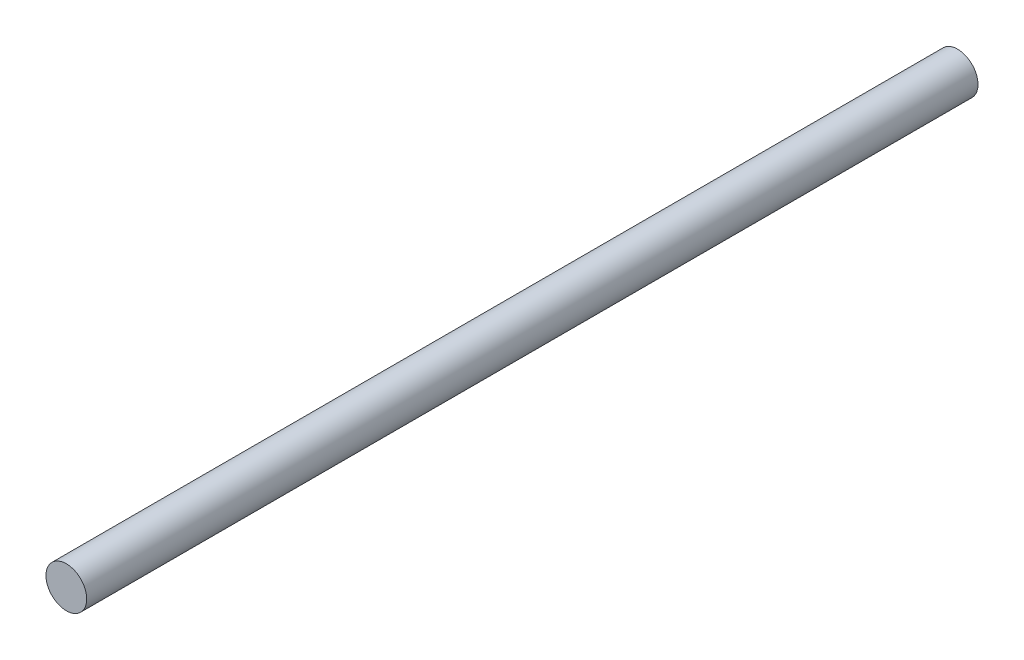
ISO-10303-21;
HEADER;
FILE_DESCRIPTION(('STEP AP214'),'2;1');
FILE_NAME('part.step','',(''),(''),'','','');
FILE_SCHEMA(('AUTOMOTIVE_DESIGN { 1 0 10303 214 1 1 1 1 }'));
ENDSEC;
DATA;
#1=APPLICATION_CONTEXT('core data for automotive mechanical design processes');
#2=APPLICATION_PROTOCOL_DEFINITION('international standard','automotive_design',2000,#1);
#3=PRODUCT_CONTEXT('',#1,'mechanical');
#4=PRODUCT('Part','Part','',(#3));
#5=PRODUCT_RELATED_PRODUCT_CATEGORY('part','',(#4));
#6=PRODUCT_DEFINITION_FORMATION('','',#4);
#7=PRODUCT_DEFINITION_CONTEXT('part definition',#1,'design');
#8=PRODUCT_DEFINITION('design','',#6,#7);
#9=PRODUCT_DEFINITION_SHAPE('','',#8);
#10=(LENGTH_UNIT() NAMED_UNIT(*) SI_UNIT(.MILLI.,.METRE.));
#11=(NAMED_UNIT(*) PLANE_ANGLE_UNIT() SI_UNIT($,.RADIAN.));
#12=(NAMED_UNIT(*) SI_UNIT($,.STERADIAN.) SOLID_ANGLE_UNIT());
#13=UNCERTAINTY_MEASURE_WITH_UNIT(LENGTH_MEASURE(1.E-05),#10,'distance_accuracy_value','');
#14=(GEOMETRIC_REPRESENTATION_CONTEXT(3) GLOBAL_UNCERTAINTY_ASSIGNED_CONTEXT((#13)) GLOBAL_UNIT_ASSIGNED_CONTEXT((#10,
#11,#12)) REPRESENTATION_CONTEXT('',''));
#15=CARTESIAN_POINT('',(0.,0.,0.));
#16=DIRECTION('',(0.,0.,1.));
#17=DIRECTION('',(1.,0.,0.));
#18=AXIS2_PLACEMENT_3D('',#15,#16,#17);
#19=CARTESIAN_POINT('',(0.,0.,175.));
#20=DIRECTION('',(0.,0.,-1.));
#21=DIRECTION('',(-1.,0.,0.));
#22=AXIS2_PLACEMENT_3D('',#19,#20,#21);
#23=CYLINDRICAL_SURFACE('',#22,4.);
#24=CARTESIAN_POINT('',(0.,0.,175.));
#25=DIRECTION('',(0.,0.,1.));
#26=DIRECTION('',(1.,0.,0.));
#27=AXIS2_PLACEMENT_3D('',#24,#25,#26);
#28=CIRCLE('',#27,4.);
#29=CARTESIAN_POINT('',(4.,0.,175.));
#30=VERTEX_POINT('',#29);
#31=EDGE_CURVE('E10',#30,#30,#28,.T.);
#32=ORIENTED_EDGE('',*,*,#31,.F.);
#33=EDGE_LOOP('',(#32));
#34=FACE_BOUND('',#33,.T.);
#35=CARTESIAN_POINT('',(0.,0.,0.));
#36=DIRECTION('',(0.,0.,1.));
#37=DIRECTION('',(1.,0.,0.));
#38=AXIS2_PLACEMENT_3D('',#35,#36,#37);
#39=CIRCLE('',#38,4.);
#40=CARTESIAN_POINT('',(4.,0.,0.));
#41=VERTEX_POINT('',#40);
#42=EDGE_CURVE('E34',#41,#41,#39,.T.);
#43=ORIENTED_EDGE('',*,*,#42,.T.);
#44=EDGE_LOOP('',(#43));
#45=FACE_BOUND('',#44,.T.);
#46=ADVANCED_FACE('F31',(#34,#45),#23,.T.);
#47=CARTESIAN_POINT('',(0.,0.,175.));
#48=DIRECTION('',(0.,0.,1.));
#49=DIRECTION('',(1.,0.,0.));
#50=AXIS2_PLACEMENT_3D('',#47,#48,#49);
#51=PLANE('',#50);
#52=ORIENTED_EDGE('',*,*,#31,.T.);
#53=EDGE_LOOP('',(#52));
#54=FACE_BOUND('',#53,.T.);
#55=ADVANCED_FACE('F46',(#54),#51,.T.);
#56=CARTESIAN_POINT('',(0.,0.,0.));
#57=DIRECTION('',(0.,0.,1.));
#58=DIRECTION('',(1.,0.,0.));
#59=AXIS2_PLACEMENT_3D('',#56,#57,#58);
#60=PLANE('',#59);
#61=ORIENTED_EDGE('',*,*,#42,.F.);
#62=EDGE_LOOP('',(#61));
#63=FACE_BOUND('',#62,.T.);
#64=ADVANCED_FACE('F44',(#63),#60,.F.);
#65=CLOSED_SHELL('',(#46,#55,#64));
#66=MANIFOLD_SOLID_BREP('B2',#65);
#67=ADVANCED_BREP_SHAPE_REPRESENTATION('',(#18,#66),#14);
#68=SHAPE_DEFINITION_REPRESENTATION(#9,#67);
ENDSEC;
END-ISO-10303-21;
